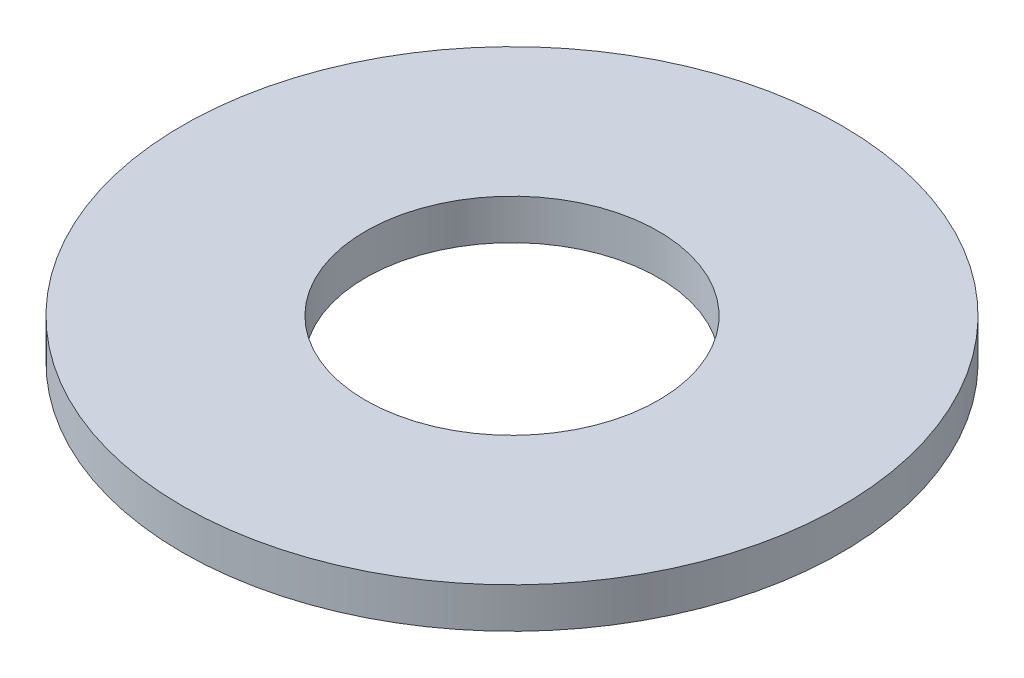
ISO-10303-21;
HEADER;
FILE_DESCRIPTION(('STEP AP214'),'2;1');
FILE_NAME('part.step','',(''),(''),'','','');
FILE_SCHEMA(('AUTOMOTIVE_DESIGN { 1 0 10303 214 1 1 1 1 }'));
ENDSEC;
DATA;
#1=APPLICATION_CONTEXT('core data for automotive mechanical design processes');
#2=APPLICATION_PROTOCOL_DEFINITION('international standard','automotive_design',2000,#1);
#3=PRODUCT_CONTEXT('',#1,'mechanical');
#4=PRODUCT('Part','Part','',(#3));
#5=PRODUCT_RELATED_PRODUCT_CATEGORY('part','',(#4));
#6=PRODUCT_DEFINITION_FORMATION('','',#4);
#7=PRODUCT_DEFINITION_CONTEXT('part definition',#1,'design');
#8=PRODUCT_DEFINITION('design','',#6,#7);
#9=PRODUCT_DEFINITION_SHAPE('','',#8);
#10=(LENGTH_UNIT() NAMED_UNIT(*) SI_UNIT(.MILLI.,.METRE.));
#11=(NAMED_UNIT(*) PLANE_ANGLE_UNIT() SI_UNIT($,.RADIAN.));
#12=(NAMED_UNIT(*) SI_UNIT($,.STERADIAN.) SOLID_ANGLE_UNIT());
#13=UNCERTAINTY_MEASURE_WITH_UNIT(LENGTH_MEASURE(1.E-05),#10,'distance_accuracy_value','');
#14=(GEOMETRIC_REPRESENTATION_CONTEXT(3) GLOBAL_UNCERTAINTY_ASSIGNED_CONTEXT((#13)) GLOBAL_UNIT_ASSIGNED_CONTEXT((#10,
#11,#12)) REPRESENTATION_CONTEXT('',''));
#15=CARTESIAN_POINT('',(0.,0.,0.));
#16=DIRECTION('',(0.,0.,1.));
#17=DIRECTION('',(1.,0.,0.));
#18=AXIS2_PLACEMENT_3D('',#15,#16,#17);
#19=CARTESIAN_POINT('',(0.,11.,0.));
#20=DIRECTION('',(0.,-1.,0.));
#21=DIRECTION('',(0.,0.,-1.));
#22=AXIS2_PLACEMENT_3D('',#19,#20,#21);
#23=CYLINDRICAL_SURFACE('',#22,90.);
#24=CARTESIAN_POINT('',(0.,11.,0.));
#25=DIRECTION('',(0.,1.,0.));
#26=DIRECTION('',(0.,0.,1.));
#27=AXIS2_PLACEMENT_3D('',#24,#25,#26);
#28=CIRCLE('',#27,90.);
#29=CARTESIAN_POINT('',(0.,11.,90.));
#30=VERTEX_POINT('',#29);
#31=EDGE_CURVE('E10',#30,#30,#28,.T.);
#32=ORIENTED_EDGE('',*,*,#31,.F.);
#33=EDGE_LOOP('',(#32));
#34=FACE_BOUND('',#33,.T.);
#35=CARTESIAN_POINT('',(0.,0.,0.));
#36=DIRECTION('',(0.,1.,0.));
#37=DIRECTION('',(0.,0.,1.));
#38=AXIS2_PLACEMENT_3D('',#35,#36,#37);
#39=CIRCLE('',#38,90.);
#40=CARTESIAN_POINT('',(0.,0.,90.));
#41=VERTEX_POINT('',#40);
#42=EDGE_CURVE('E37',#41,#41,#39,.T.);
#43=ORIENTED_EDGE('',*,*,#42,.T.);
#44=EDGE_LOOP('',(#43));
#45=FACE_BOUND('',#44,.T.);
#46=ADVANCED_FACE('F40',(#34,#45),#23,.T.);
#47=CARTESIAN_POINT('',(0.,11.,0.));
#48=DIRECTION('',(0.,1.,0.));
#49=DIRECTION('',(0.,0.,1.));
#50=AXIS2_PLACEMENT_3D('',#47,#48,#49);
#51=PLANE('',#50);
#52=CARTESIAN_POINT('',(0.,11.,0.));
#53=DIRECTION('',(0.,1.,0.));
#54=DIRECTION('',(0.,0.,1.));
#55=AXIS2_PLACEMENT_3D('',#52,#53,#54);
#56=CIRCLE('',#55,40.);
#57=CARTESIAN_POINT('',(0.,11.,40.));
#58=VERTEX_POINT('',#57);
#59=EDGE_CURVE('E50',#58,#58,#56,.T.);
#60=ORIENTED_EDGE('',*,*,#59,.F.);
#61=EDGE_LOOP('',(#60));
#62=FACE_BOUND('',#61,.T.);
#63=ORIENTED_EDGE('',*,*,#31,.T.);
#64=EDGE_LOOP('',(#63));
#65=FACE_BOUND('',#64,.T.);
#66=ADVANCED_FACE('F59',(#62,#65),#51,.T.);
#67=CARTESIAN_POINT('',(0.,0.,0.));
#68=DIRECTION('',(0.,1.,0.));
#69=DIRECTION('',(0.,0.,1.));
#70=AXIS2_PLACEMENT_3D('',#67,#68,#69);
#71=PLANE('',#70);
#72=CARTESIAN_POINT('',(0.,0.,0.));
#73=DIRECTION('',(0.,1.,0.));
#74=DIRECTION('',(0.,0.,1.));
#75=AXIS2_PLACEMENT_3D('',#72,#73,#74);
#76=CIRCLE('',#75,40.);
#77=CARTESIAN_POINT('',(0.,0.,40.));
#78=VERTEX_POINT('',#77);
#79=EDGE_CURVE('E47',#78,#78,#76,.T.);
#80=ORIENTED_EDGE('',*,*,#79,.T.);
#81=EDGE_LOOP('',(#80));
#82=FACE_BOUND('',#81,.T.);
#83=ORIENTED_EDGE('',*,*,#42,.F.);
#84=EDGE_LOOP('',(#83));
#85=FACE_BOUND('',#84,.T.);
#86=ADVANCED_FACE('F58',(#82,#85),#71,.F.);
#87=CARTESIAN_POINT('',(0.,11.,0.));
#88=DIRECTION('',(0.,-1.,0.));
#89=DIRECTION('',(0.,0.,-1.));
#90=AXIS2_PLACEMENT_3D('',#87,#88,#89);
#91=CYLINDRICAL_SURFACE('',#90,40.);
#92=ORIENTED_EDGE('',*,*,#59,.T.);
#93=EDGE_LOOP('',(#92));
#94=FACE_BOUND('',#93,.T.);
#95=ORIENTED_EDGE('',*,*,#79,.F.);
#96=EDGE_LOOP('',(#95));
#97=FACE_BOUND('',#96,.T.);
#98=ADVANCED_FACE('F54',(#94,#97),#91,.F.);
#99=CLOSED_SHELL('',(#46,#66,#86,#98));
#100=MANIFOLD_SOLID_BREP('B2',#99);
#101=ADVANCED_BREP_SHAPE_REPRESENTATION('',(#18,#100),#14);
#102=SHAPE_DEFINITION_REPRESENTATION(#9,#101);
ENDSEC;
END-ISO-10303-21;
